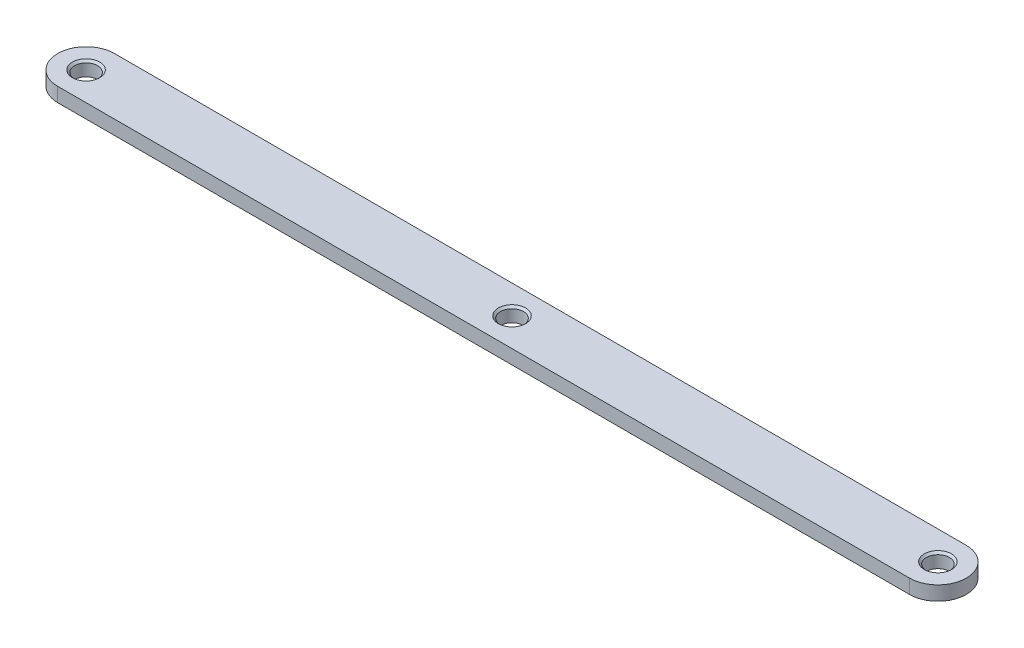
ISO-10303-21;
HEADER;
FILE_DESCRIPTION(('STEP AP214'),'2;1');
FILE_NAME('part.step','',(''),(''),'','','');
FILE_SCHEMA(('AUTOMOTIVE_DESIGN { 1 0 10303 214 1 1 1 1 }'));
ENDSEC;
DATA;
#1=APPLICATION_CONTEXT('core data for automotive mechanical design processes');
#2=APPLICATION_PROTOCOL_DEFINITION('international standard','automotive_design',2000,#1);
#3=PRODUCT_CONTEXT('',#1,'mechanical');
#4=PRODUCT('Part','Part','',(#3));
#5=PRODUCT_RELATED_PRODUCT_CATEGORY('part','',(#4));
#6=PRODUCT_DEFINITION_FORMATION('','',#4);
#7=PRODUCT_DEFINITION_CONTEXT('part definition',#1,'design');
#8=PRODUCT_DEFINITION('design','',#6,#7);
#9=PRODUCT_DEFINITION_SHAPE('','',#8);
#10=(LENGTH_UNIT() NAMED_UNIT(*) SI_UNIT(.MILLI.,.METRE.));
#11=(NAMED_UNIT(*) PLANE_ANGLE_UNIT() SI_UNIT($,.RADIAN.));
#12=(NAMED_UNIT(*) SI_UNIT($,.STERADIAN.) SOLID_ANGLE_UNIT());
#13=UNCERTAINTY_MEASURE_WITH_UNIT(LENGTH_MEASURE(1.E-05),#10,'distance_accuracy_value','');
#14=(GEOMETRIC_REPRESENTATION_CONTEXT(3) GLOBAL_UNCERTAINTY_ASSIGNED_CONTEXT((#13)) GLOBAL_UNIT_ASSIGNED_CONTEXT((#10,
#11,#12)) REPRESENTATION_CONTEXT('',''));
#15=CARTESIAN_POINT('',(0.,0.,0.));
#16=DIRECTION('',(0.,0.,1.));
#17=DIRECTION('',(1.,0.,0.));
#18=AXIS2_PLACEMENT_3D('',#15,#16,#17);
#19=CARTESIAN_POINT('',(-95.25,3.175,0.));
#20=DIRECTION('',(0.,1.,0.));
#21=DIRECTION('',(0.,0.,1.));
#22=AXIS2_PLACEMENT_3D('',#19,#20,#21);
#23=PLANE('',#22);
#24=CARTESIAN_POINT('',(-95.25,3.175,0.));
#25=DIRECTION('',(0.,1.,0.));
#26=DIRECTION('',(0.,0.,1.));
#27=AXIS2_PLACEMENT_3D('',#24,#25,#26);
#28=CIRCLE('',#27,3.048);
#29=CARTESIAN_POINT('',(-95.25,3.175,3.048));
#30=VERTEX_POINT('',#29);
#31=EDGE_CURVE('E146',#30,#30,#28,.T.);
#32=ORIENTED_EDGE('',*,*,#31,.F.);
#33=EDGE_LOOP('',(#32));
#34=FACE_BOUND('',#33,.T.);
#35=CARTESIAN_POINT('',(0.,3.175,0.));
#36=DIRECTION('',(0.,1.,0.));
#37=DIRECTION('',(0.,0.,1.));
#38=AXIS2_PLACEMENT_3D('',#35,#36,#37);
#39=CIRCLE('',#38,3.048);
#40=CARTESIAN_POINT('',(0.,3.175,3.048));
#41=VERTEX_POINT('',#40);
#42=EDGE_CURVE('E133',#41,#41,#39,.T.);
#43=ORIENTED_EDGE('',*,*,#42,.F.);
#44=EDGE_LOOP('',(#43));
#45=FACE_BOUND('',#44,.T.);
#46=CARTESIAN_POINT('',(95.25,3.175,0.));
#47=DIRECTION('',(0.,1.,0.));
#48=DIRECTION('',(0.,0.,1.));
#49=AXIS2_PLACEMENT_3D('',#46,#47,#48);
#50=CIRCLE('',#49,3.048);
#51=CARTESIAN_POINT('',(95.25,3.175,3.04799999999996));
#52=VERTEX_POINT('',#51);
#53=EDGE_CURVE('E129',#52,#52,#50,.T.);
#54=ORIENTED_EDGE('',*,*,#53,.F.);
#55=EDGE_LOOP('',(#54));
#56=FACE_BOUND('',#55,.T.);
#57=CARTESIAN_POINT('',(-95.25,3.175,0.));
#58=DIRECTION('',(0.,1.,0.));
#59=DIRECTION('',(0.,0.,1.));
#60=AXIS2_PLACEMENT_3D('',#57,#58,#59);
#61=CIRCLE('',#60,6.35000000000003);
#62=CARTESIAN_POINT('',(-95.25,3.175,-6.35000000000003));
#63=VERTEX_POINT('',#62);
#64=CARTESIAN_POINT('',(-95.25,3.175,6.35000000000003));
#65=VERTEX_POINT('',#64);
#66=EDGE_CURVE('E93',#63,#65,#61,.T.);
#67=ORIENTED_EDGE('',*,*,#66,.T.);
#68=DIRECTION('',(1.,0.,0.));
#69=VECTOR('',#68,1.);
#70=CARTESIAN_POINT('',(-95.25,3.175,6.35000000000003));
#71=LINE('',#70,#69);
#72=CARTESIAN_POINT('',(95.25,3.175,6.35));
#73=VERTEX_POINT('',#72);
#74=EDGE_CURVE('E89',#65,#73,#71,.T.);
#75=ORIENTED_EDGE('',*,*,#74,.T.);
#76=CARTESIAN_POINT('',(95.25,3.175,0.));
#77=DIRECTION('',(0.,1.,0.));
#78=DIRECTION('',(0.,0.,1.));
#79=AXIS2_PLACEMENT_3D('',#76,#77,#78);
#80=CIRCLE('',#79,6.35000000000003);
#81=CARTESIAN_POINT('',(95.25,3.175,-6.35000000000007));
#82=VERTEX_POINT('',#81);
#83=EDGE_CURVE('E91',#73,#82,#80,.T.);
#84=ORIENTED_EDGE('',*,*,#83,.T.);
#85=DIRECTION('',(-1.,0.,0.));
#86=VECTOR('',#85,1.);
#87=CARTESIAN_POINT('',(-95.25,3.175,-6.35000000000003));
#88=LINE('',#87,#86);
#89=EDGE_CURVE('E59',#82,#63,#88,.T.);
#90=ORIENTED_EDGE('',*,*,#89,.T.);
#91=EDGE_LOOP('',(#67,#75,#84,#90));
#92=FACE_BOUND('',#91,.T.);
#93=ADVANCED_FACE('F39',(#34,#45,#56,#92),#23,.T.);
#94=CARTESIAN_POINT('',(-95.25,0.,0.));
#95=DIRECTION('',(0.,1.,0.));
#96=DIRECTION('',(0.,0.,1.));
#97=AXIS2_PLACEMENT_3D('',#94,#95,#96);
#98=PLANE('',#97);
#99=CARTESIAN_POINT('',(-95.25,0.,0.));
#100=DIRECTION('',(0.,1.,0.));
#101=DIRECTION('',(0.,0.,1.));
#102=AXIS2_PLACEMENT_3D('',#99,#100,#101);
#103=CIRCLE('',#102,6.35000000000003);
#104=CARTESIAN_POINT('',(-95.25,0.,-6.35000000000003));
#105=VERTEX_POINT('',#104);
#106=CARTESIAN_POINT('',(-95.25,0.,6.35000000000003));
#107=VERTEX_POINT('',#106);
#108=EDGE_CURVE('E110',#105,#107,#103,.T.);
#109=ORIENTED_EDGE('',*,*,#108,.F.);
#110=DIRECTION('',(-1.,0.,0.));
#111=VECTOR('',#110,1.);
#112=CARTESIAN_POINT('',(-95.25,0.,-6.35000000000003));
#113=LINE('',#112,#111);
#114=CARTESIAN_POINT('',(95.25,0.,-6.35000000000007));
#115=VERTEX_POINT('',#114);
#116=EDGE_CURVE('E82',#115,#105,#113,.T.);
#117=ORIENTED_EDGE('',*,*,#116,.F.);
#118=CARTESIAN_POINT('',(95.25,0.,0.));
#119=DIRECTION('',(0.,1.,0.));
#120=DIRECTION('',(0.,0.,1.));
#121=AXIS2_PLACEMENT_3D('',#118,#119,#120);
#122=CIRCLE('',#121,6.35000000000003);
#123=CARTESIAN_POINT('',(95.25,0.,6.35));
#124=VERTEX_POINT('',#123);
#125=EDGE_CURVE('E76',#124,#115,#122,.T.);
#126=ORIENTED_EDGE('',*,*,#125,.F.);
#127=DIRECTION('',(1.,0.,0.));
#128=VECTOR('',#127,1.);
#129=CARTESIAN_POINT('',(-95.25,0.,6.35000000000003));
#130=LINE('',#129,#128);
#131=EDGE_CURVE('E98',#107,#124,#130,.T.);
#132=ORIENTED_EDGE('',*,*,#131,.F.);
#133=EDGE_LOOP('',(#109,#117,#126,#132));
#134=FACE_BOUND('',#133,.T.);
#135=CARTESIAN_POINT('',(95.25,0.,0.));
#136=DIRECTION('',(0.,1.,0.));
#137=DIRECTION('',(0.,0.,1.));
#138=AXIS2_PLACEMENT_3D('',#135,#136,#137);
#139=CIRCLE('',#138,2.5796875);
#140=CARTESIAN_POINT('',(95.25,0.,2.57968749999996));
#141=VERTEX_POINT('',#140);
#142=EDGE_CURVE('E114',#141,#141,#139,.T.);
#143=ORIENTED_EDGE('',*,*,#142,.T.);
#144=EDGE_LOOP('',(#143));
#145=FACE_BOUND('',#144,.T.);
#146=CARTESIAN_POINT('',(-95.25,0.,0.));
#147=DIRECTION('',(0.,1.,0.));
#148=DIRECTION('',(0.,0.,1.));
#149=AXIS2_PLACEMENT_3D('',#146,#147,#148);
#150=CIRCLE('',#149,2.5796875);
#151=CARTESIAN_POINT('',(-95.25,0.,2.5796875));
#152=VERTEX_POINT('',#151);
#153=EDGE_CURVE('E152',#152,#152,#150,.T.);
#154=ORIENTED_EDGE('',*,*,#153,.T.);
#155=EDGE_LOOP('',(#154));
#156=FACE_BOUND('',#155,.T.);
#157=CARTESIAN_POINT('',(0.,0.,0.));
#158=DIRECTION('',(0.,1.,0.));
#159=DIRECTION('',(0.,0.,1.));
#160=AXIS2_PLACEMENT_3D('',#157,#158,#159);
#161=CIRCLE('',#160,2.5796875);
#162=CARTESIAN_POINT('',(0.,0.,2.5796875));
#163=VERTEX_POINT('',#162);
#164=EDGE_CURVE('E128',#163,#163,#161,.T.);
#165=ORIENTED_EDGE('',*,*,#164,.T.);
#166=EDGE_LOOP('',(#165));
#167=FACE_BOUND('',#166,.T.);
#168=ADVANCED_FACE('F161',(#134,#145,#156,#167),#98,.F.);
#169=CARTESIAN_POINT('',(-95.25,3.175,0.));
#170=DIRECTION('',(0.,-1.,0.));
#171=DIRECTION('',(0.,0.,-1.));
#172=AXIS2_PLACEMENT_3D('',#169,#170,#171);
#173=CYLINDRICAL_SURFACE('',#172,6.35000000000003);
#174=ORIENTED_EDGE('',*,*,#108,.T.);
#175=DIRECTION('',(0.,-1.,0.));
#176=VECTOR('',#175,1.);
#177=CARTESIAN_POINT('',(-95.25,3.175,6.35000000000003));
#178=LINE('',#177,#176);
#179=EDGE_CURVE('E11',#65,#107,#178,.T.);
#180=ORIENTED_EDGE('',*,*,#179,.F.);
#181=ORIENTED_EDGE('',*,*,#66,.F.);
#182=DIRECTION('',(0.,-1.,0.));
#183=VECTOR('',#182,1.);
#184=CARTESIAN_POINT('',(-95.25,3.175,-6.35000000000003));
#185=LINE('',#184,#183);
#186=EDGE_CURVE('E106',#63,#105,#185,.T.);
#187=ORIENTED_EDGE('',*,*,#186,.T.);
#188=EDGE_LOOP('',(#174,#180,#181,#187));
#189=FACE_BOUND('',#188,.T.);
#190=ADVANCED_FACE('F41',(#189),#173,.T.);
#191=CARTESIAN_POINT('',(-95.25,3.175,6.35000000000003));
#192=DIRECTION('',(0.,0.,-1.));
#193=DIRECTION('',(-1.,0.,0.));
#194=AXIS2_PLACEMENT_3D('',#191,#192,#193);
#195=PLANE('',#194);
#196=ORIENTED_EDGE('',*,*,#131,.T.);
#197=DIRECTION('',(0.,-1.,0.));
#198=VECTOR('',#197,1.);
#199=CARTESIAN_POINT('',(95.25,3.175,6.35));
#200=LINE('',#199,#198);
#201=EDGE_CURVE('E50',#73,#124,#200,.T.);
#202=ORIENTED_EDGE('',*,*,#201,.F.);
#203=ORIENTED_EDGE('',*,*,#74,.F.);
#204=ORIENTED_EDGE('',*,*,#179,.T.);
#205=EDGE_LOOP('',(#196,#202,#203,#204));
#206=FACE_BOUND('',#205,.T.);
#207=ADVANCED_FACE('F97',(#206),#195,.F.);
#208=CARTESIAN_POINT('',(95.25,3.175,0.));
#209=DIRECTION('',(0.,-1.,0.));
#210=DIRECTION('',(0.,0.,-1.));
#211=AXIS2_PLACEMENT_3D('',#208,#209,#210);
#212=CYLINDRICAL_SURFACE('',#211,6.35000000000003);
#213=ORIENTED_EDGE('',*,*,#125,.T.);
#214=DIRECTION('',(0.,-1.,0.));
#215=VECTOR('',#214,1.);
#216=CARTESIAN_POINT('',(95.25,3.175,-6.35000000000007));
#217=LINE('',#216,#215);
#218=EDGE_CURVE('E100',#82,#115,#217,.T.);
#219=ORIENTED_EDGE('',*,*,#218,.F.);
#220=ORIENTED_EDGE('',*,*,#83,.F.);
#221=ORIENTED_EDGE('',*,*,#201,.T.);
#222=EDGE_LOOP('',(#213,#219,#220,#221));
#223=FACE_BOUND('',#222,.T.);
#224=ADVANCED_FACE('F102',(#223),#212,.T.);
#225=CARTESIAN_POINT('',(-95.25,3.175,-6.35000000000003));
#226=DIRECTION('',(0.,0.,1.));
#227=DIRECTION('',(1.,0.,0.));
#228=AXIS2_PLACEMENT_3D('',#225,#226,#227);
#229=PLANE('',#228);
#230=ORIENTED_EDGE('',*,*,#116,.T.);
#231=ORIENTED_EDGE('',*,*,#186,.F.);
#232=ORIENTED_EDGE('',*,*,#89,.F.);
#233=ORIENTED_EDGE('',*,*,#218,.T.);
#234=EDGE_LOOP('',(#230,#231,#232,#233));
#235=FACE_BOUND('',#234,.T.);
#236=ADVANCED_FACE('F167',(#235),#229,.F.);
#237=CARTESIAN_POINT('',(95.25,3.175,0.));
#238=DIRECTION('',(0.,-1.,0.));
#239=DIRECTION('',(0.,0.,-1.));
#240=AXIS2_PLACEMENT_3D('',#237,#238,#239);
#241=CYLINDRICAL_SURFACE('',#240,2.5796875);
#242=CARTESIAN_POINT('',(95.25,2.7066875,0.));
#243=DIRECTION('',(0.,1.,0.));
#244=DIRECTION('',(0.,0.,1.));
#245=AXIS2_PLACEMENT_3D('',#242,#243,#244);
#246=CIRCLE('',#245,2.5796875);
#247=CARTESIAN_POINT('',(95.25,2.7066875,2.57968749999996));
#248=VERTEX_POINT('',#247);
#249=EDGE_CURVE('E125',#248,#248,#246,.F.);
#250=ORIENTED_EDGE('',*,*,#249,.F.);
#251=EDGE_LOOP('',(#250));
#252=FACE_BOUND('',#251,.T.);
#253=ORIENTED_EDGE('',*,*,#142,.F.);
#254=EDGE_LOOP('',(#253));
#255=FACE_BOUND('',#254,.T.);
#256=ADVANCED_FACE('F164',(#252,#255),#241,.F.);
#257=CARTESIAN_POINT('',(-95.25,3.175,0.));
#258=DIRECTION('',(0.,-1.,0.));
#259=DIRECTION('',(0.,0.,-1.));
#260=AXIS2_PLACEMENT_3D('',#257,#258,#259);
#261=CYLINDRICAL_SURFACE('',#260,2.5796875);
#262=CARTESIAN_POINT('',(-95.25,2.7066875,0.));
#263=DIRECTION('',(0.,1.,0.));
#264=DIRECTION('',(0.,0.,1.));
#265=AXIS2_PLACEMENT_3D('',#262,#263,#264);
#266=CIRCLE('',#265,2.5796875);
#267=CARTESIAN_POINT('',(-95.25,2.7066875,2.5796875));
#268=VERTEX_POINT('',#267);
#269=EDGE_CURVE('E43',#268,#268,#266,.F.);
#270=ORIENTED_EDGE('',*,*,#269,.F.);
#271=EDGE_LOOP('',(#270));
#272=FACE_BOUND('',#271,.T.);
#273=ORIENTED_EDGE('',*,*,#153,.F.);
#274=EDGE_LOOP('',(#273));
#275=FACE_BOUND('',#274,.T.);
#276=ADVANCED_FACE('F166',(#272,#275),#261,.F.);
#277=CARTESIAN_POINT('',(0.,3.175,0.));
#278=DIRECTION('',(0.,-1.,0.));
#279=DIRECTION('',(0.,0.,-1.));
#280=AXIS2_PLACEMENT_3D('',#277,#278,#279);
#281=CYLINDRICAL_SURFACE('',#280,2.5796875);
#282=CARTESIAN_POINT('',(0.,2.7066875,0.));
#283=DIRECTION('',(0.,1.,0.));
#284=DIRECTION('',(0.,0.,1.));
#285=AXIS2_PLACEMENT_3D('',#282,#283,#284);
#286=CIRCLE('',#285,2.5796875);
#287=CARTESIAN_POINT('',(0.,2.7066875,2.5796875));
#288=VERTEX_POINT('',#287);
#289=EDGE_CURVE('E130',#288,#288,#286,.F.);
#290=ORIENTED_EDGE('',*,*,#289,.F.);
#291=EDGE_LOOP('',(#290));
#292=FACE_BOUND('',#291,.T.);
#293=ORIENTED_EDGE('',*,*,#164,.F.);
#294=EDGE_LOOP('',(#293));
#295=FACE_BOUND('',#294,.T.);
#296=ADVANCED_FACE('F174',(#292,#295),#281,.F.);
#297=CARTESIAN_POINT('',(95.25,3.175,0.));
#298=DIRECTION('',(0.,1.,0.));
#299=DIRECTION('',(0.,0.,1.));
#300=AXIS2_PLACEMENT_3D('',#297,#298,#299);
#301=CONICAL_SURFACE('',#300,3.048,0.785398163397444);
#302=ORIENTED_EDGE('',*,*,#249,.T.);
#303=EDGE_LOOP('',(#302));
#304=FACE_BOUND('',#303,.T.);
#305=ORIENTED_EDGE('',*,*,#53,.T.);
#306=EDGE_LOOP('',(#305));
#307=FACE_BOUND('',#306,.T.);
#308=ADVANCED_FACE('F242',(#304,#307),#301,.F.);
#309=CARTESIAN_POINT('',(0.,3.175,0.));
#310=DIRECTION('',(0.,1.,0.));
#311=DIRECTION('',(0.,0.,1.));
#312=AXIS2_PLACEMENT_3D('',#309,#310,#311);
#313=CONICAL_SURFACE('',#312,3.048,0.785398163397448);
#314=ORIENTED_EDGE('',*,*,#289,.T.);
#315=EDGE_LOOP('',(#314));
#316=FACE_BOUND('',#315,.T.);
#317=ORIENTED_EDGE('',*,*,#42,.T.);
#318=EDGE_LOOP('',(#317));
#319=FACE_BOUND('',#318,.T.);
#320=ADVANCED_FACE('F251',(#316,#319),#313,.F.);
#321=CARTESIAN_POINT('',(-95.25,3.175,0.));
#322=DIRECTION('',(0.,1.,0.));
#323=DIRECTION('',(0.,0.,1.));
#324=AXIS2_PLACEMENT_3D('',#321,#322,#323);
#325=CONICAL_SURFACE('',#324,3.048,0.785398163397444);
#326=ORIENTED_EDGE('',*,*,#269,.T.);
#327=EDGE_LOOP('',(#326));
#328=FACE_BOUND('',#327,.T.);
#329=ORIENTED_EDGE('',*,*,#31,.T.);
#330=EDGE_LOOP('',(#329));
#331=FACE_BOUND('',#330,.T.);
#332=ADVANCED_FACE('F260',(#328,#331),#325,.F.);
#333=CLOSED_SHELL('',(#93,#168,#190,#207,#224,#236,#256,#276,#296,#308,#320,#332));
#334=MANIFOLD_SOLID_BREP('B2',#333);
#335=ADVANCED_BREP_SHAPE_REPRESENTATION('',(#18,#334),#14);
#336=SHAPE_DEFINITION_REPRESENTATION(#9,#335);
ENDSEC;
END-ISO-10303-21;
